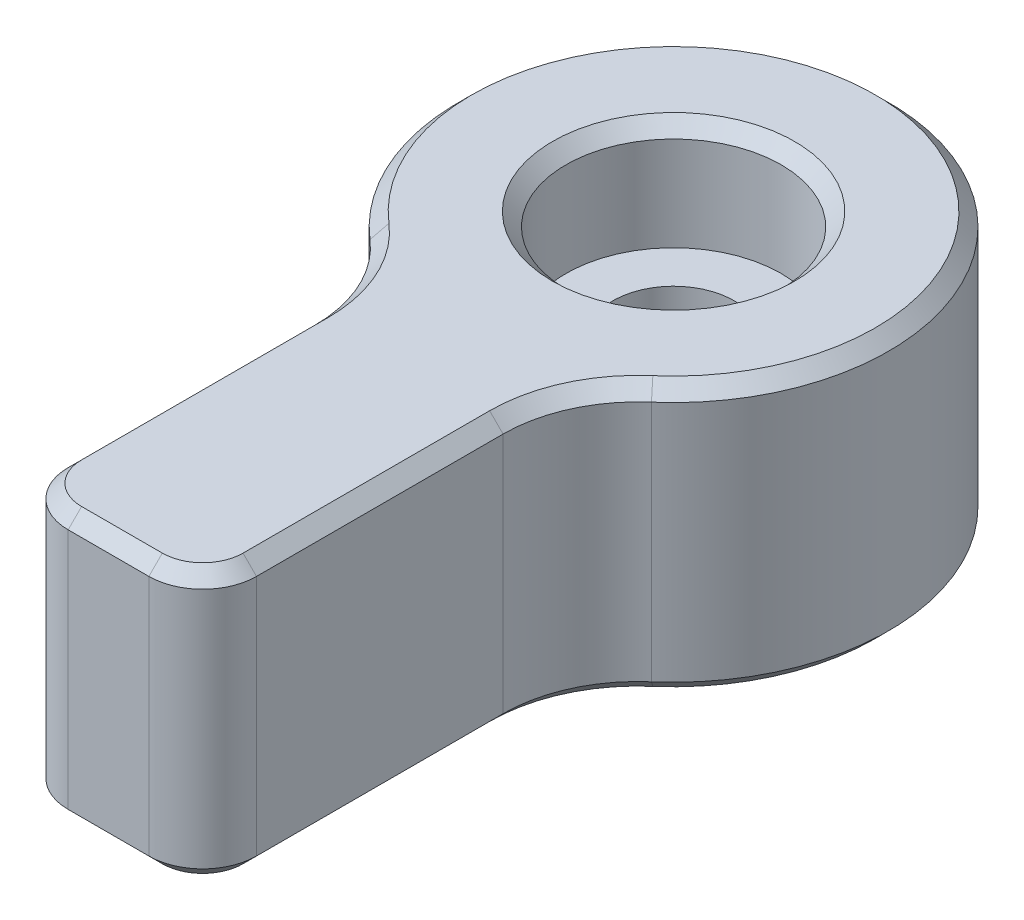
ISO-10303-21;
HEADER;
FILE_DESCRIPTION(('STEP AP214'),'2;1');
FILE_NAME('part.step','',(''),(''),'','','');
FILE_SCHEMA(('AUTOMOTIVE_DESIGN { 1 0 10303 214 1 1 1 1 }'));
ENDSEC;
DATA;
#1=APPLICATION_CONTEXT('core data for automotive mechanical design processes');
#2=APPLICATION_PROTOCOL_DEFINITION('international standard','automotive_design',2000,#1);
#3=PRODUCT_CONTEXT('',#1,'mechanical');
#4=PRODUCT('Part','Part','',(#3));
#5=PRODUCT_RELATED_PRODUCT_CATEGORY('part','',(#4));
#6=PRODUCT_DEFINITION_FORMATION('','',#4);
#7=PRODUCT_DEFINITION_CONTEXT('part definition',#1,'design');
#8=PRODUCT_DEFINITION('design','',#6,#7);
#9=PRODUCT_DEFINITION_SHAPE('','',#8);
#10=(LENGTH_UNIT() NAMED_UNIT(*) SI_UNIT(.MILLI.,.METRE.));
#11=(NAMED_UNIT(*) PLANE_ANGLE_UNIT() SI_UNIT($,.RADIAN.));
#12=(NAMED_UNIT(*) SI_UNIT($,.STERADIAN.) SOLID_ANGLE_UNIT());
#13=UNCERTAINTY_MEASURE_WITH_UNIT(LENGTH_MEASURE(1.E-05),#10,'distance_accuracy_value','');
#14=(GEOMETRIC_REPRESENTATION_CONTEXT(3) GLOBAL_UNCERTAINTY_ASSIGNED_CONTEXT((#13)) GLOBAL_UNIT_ASSIGNED_CONTEXT((#10,
#11,#12)) REPRESENTATION_CONTEXT('',''));
#15=CARTESIAN_POINT('',(0.,0.,0.));
#16=DIRECTION('',(0.,0.,1.));
#17=DIRECTION('',(1.,0.,0.));
#18=AXIS2_PLACEMENT_3D('',#15,#16,#17);
#19=CARTESIAN_POINT('',(3.5,10.,7.19374728496908));
#20=DIRECTION('',(-1.,0.,0.));
#21=DIRECTION('',(0.,0.,1.));
#22=AXIS2_PLACEMENT_3D('',#19,#20,#21);
#23=PLANE('',#22);
#24=DIRECTION('',(0.,-1.,0.));
#25=VECTOR('',#24,1.);
#26=CARTESIAN_POINT('',(3.50000000000001,10.,19.));
#27=LINE('',#26,#25);
#28=CARTESIAN_POINT('',(3.50000000000001,9.5,19.));
#29=VERTEX_POINT('',#28);
#30=CARTESIAN_POINT('',(3.50000000000001,0.5,19.));
#31=VERTEX_POINT('',#30);
#32=EDGE_CURVE('E334',#29,#31,#27,.T.);
#33=ORIENTED_EDGE('',*,*,#32,.T.);
#34=DIRECTION('',(0.,0.,-1.));
#35=VECTOR('',#34,1.);
#36=CARTESIAN_POINT('',(3.5,0.5,7.19374728496908));
#37=LINE('',#36,#35);
#38=CARTESIAN_POINT('',(3.50000000000001,0.5,9.836157786453));
#39=VERTEX_POINT('',#38);
#40=EDGE_CURVE('E211',#31,#39,#37,.T.);
#41=ORIENTED_EDGE('',*,*,#40,.T.);
#42=DIRECTION('',(0.,1.,0.));
#43=VECTOR('',#42,1.);
#44=CARTESIAN_POINT('',(3.50000000000001,10.,9.836157786453));
#45=LINE('',#44,#43);
#46=CARTESIAN_POINT('',(3.50000000000001,9.5,9.836157786453));
#47=VERTEX_POINT('',#46);
#48=EDGE_CURVE('E287',#39,#47,#45,.T.);
#49=ORIENTED_EDGE('',*,*,#48,.T.);
#50=DIRECTION('',(0.,0.,1.));
#51=VECTOR('',#50,1.);
#52=CARTESIAN_POINT('',(3.50000000000001,9.5,19.));
#53=LINE('',#52,#51);
#54=EDGE_CURVE('E209',#47,#29,#53,.T.);
#55=ORIENTED_EDGE('',*,*,#54,.T.);
#56=EDGE_LOOP('',(#33,#41,#49,#55));
#57=FACE_BOUND('',#56,.T.);
#58=ADVANCED_FACE('F34',(#57),#23,.F.);
#59=CARTESIAN_POINT('',(0.,10.,0.));
#60=DIRECTION('',(0.,-1.,0.));
#61=DIRECTION('',(0.,0.,-1.));
#62=AXIS2_PLACEMENT_3D('',#59,#60,#61);
#63=CYLINDRICAL_SURFACE('',#62,8.);
#64=DIRECTION('',(0.,-1.,0.));
#65=VECTOR('',#64,1.);
#66=CARTESIAN_POINT('',(5.23076923076923,10.,6.05302017627876));
#67=LINE('',#66,#65);
#68=CARTESIAN_POINT('',(5.23076923076923,9.5,6.05302017627876));
#69=VERTEX_POINT('',#68);
#70=CARTESIAN_POINT('',(5.23076923076923,0.5,6.05302017627876));
#71=VERTEX_POINT('',#70);
#72=EDGE_CURVE('E289',#69,#71,#67,.T.);
#73=ORIENTED_EDGE('',*,*,#72,.T.);
#74=CARTESIAN_POINT('',(0.,0.5,0.));
#75=DIRECTION('',(0.,1.,0.));
#76=DIRECTION('',(0.,0.,1.));
#77=AXIS2_PLACEMENT_3D('',#74,#75,#76);
#78=CIRCLE('',#77,8.);
#79=CARTESIAN_POINT('',(-5.23076923076923,0.5,6.05302017627877));
#80=VERTEX_POINT('',#79);
#81=EDGE_CURVE('E186',#71,#80,#78,.T.);
#82=ORIENTED_EDGE('',*,*,#81,.T.);
#83=DIRECTION('',(0.,-1.,0.));
#84=VECTOR('',#83,1.);
#85=CARTESIAN_POINT('',(-5.23076923076923,10.,6.05302017627877));
#86=LINE('',#85,#84);
#87=CARTESIAN_POINT('',(-5.23076923076923,9.5,6.05302017627877));
#88=VERTEX_POINT('',#87);
#89=EDGE_CURVE('E297',#80,#88,#86,.F.);
#90=ORIENTED_EDGE('',*,*,#89,.T.);
#91=CARTESIAN_POINT('',(0.,9.5,0.));
#92=DIRECTION('',(0.,1.,0.));
#93=DIRECTION('',(0.,0.,1.));
#94=AXIS2_PLACEMENT_3D('',#91,#92,#93);
#95=CIRCLE('',#94,8.);
#96=EDGE_CURVE('E184',#88,#69,#95,.F.);
#97=ORIENTED_EDGE('',*,*,#96,.T.);
#98=EDGE_LOOP('',(#73,#82,#90,#97));
#99=FACE_BOUND('',#98,.T.);
#100=ADVANCED_FACE('F322',(#99),#63,.T.);
#101=CARTESIAN_POINT('',(-3.49999999999999,10.,7.19374728496908));
#102=DIRECTION('',(1.,0.,0.));
#103=DIRECTION('',(0.,0.,-1.));
#104=AXIS2_PLACEMENT_3D('',#101,#102,#103);
#105=PLANE('',#104);
#106=DIRECTION('',(0.,1.,0.));
#107=VECTOR('',#106,1.);
#108=CARTESIAN_POINT('',(-3.49999999999999,0.,9.836157786453));
#109=LINE('',#108,#107);
#110=CARTESIAN_POINT('',(-3.49999999999999,9.5,9.836157786453));
#111=VERTEX_POINT('',#110);
#112=CARTESIAN_POINT('',(-3.49999999999999,0.5,9.836157786453));
#113=VERTEX_POINT('',#112);
#114=EDGE_CURVE('E293',#111,#113,#109,.F.);
#115=ORIENTED_EDGE('',*,*,#114,.T.);
#116=DIRECTION('',(0.,0.,1.));
#117=VECTOR('',#116,1.);
#118=CARTESIAN_POINT('',(-3.49999999999999,0.5,7.19374728496908));
#119=LINE('',#118,#117);
#120=CARTESIAN_POINT('',(-3.49999999999999,0.5,19.));
#121=VERTEX_POINT('',#120);
#122=EDGE_CURVE('E194',#113,#121,#119,.T.);
#123=ORIENTED_EDGE('',*,*,#122,.T.);
#124=DIRECTION('',(0.,-1.,0.));
#125=VECTOR('',#124,1.);
#126=CARTESIAN_POINT('',(-3.49999999999999,10.,19.));
#127=LINE('',#126,#125);
#128=CARTESIAN_POINT('',(-3.49999999999999,9.5,19.));
#129=VERTEX_POINT('',#128);
#130=EDGE_CURVE('E324',#121,#129,#127,.F.);
#131=ORIENTED_EDGE('',*,*,#130,.T.);
#132=DIRECTION('',(0.,0.,-1.));
#133=VECTOR('',#132,1.);
#134=CARTESIAN_POINT('',(-3.49999999999999,9.5,9.836157786453));
#135=LINE('',#134,#133);
#136=EDGE_CURVE('E192',#129,#111,#135,.T.);
#137=ORIENTED_EDGE('',*,*,#136,.T.);
#138=EDGE_LOOP('',(#115,#123,#131,#137));
#139=FACE_BOUND('',#138,.T.);
#140=ADVANCED_FACE('F364',(#139),#105,.F.);
#141=CARTESIAN_POINT('',(-3.49999999999999,10.,21.));
#142=DIRECTION('',(0.,0.,-1.));
#143=DIRECTION('',(-1.,0.,0.));
#144=AXIS2_PLACEMENT_3D('',#141,#142,#143);
#145=PLANE('',#144);
#146=DIRECTION('',(0.,-1.,0.));
#147=VECTOR('',#146,1.);
#148=CARTESIAN_POINT('',(-1.49999999999999,10.,21.));
#149=LINE('',#148,#147);
#150=CARTESIAN_POINT('',(-1.49999999999999,9.5,21.));
#151=VERTEX_POINT('',#150);
#152=CARTESIAN_POINT('',(-1.49999999999999,0.5,21.));
#153=VERTEX_POINT('',#152);
#154=EDGE_CURVE('E331',#151,#153,#149,.T.);
#155=ORIENTED_EDGE('',*,*,#154,.T.);
#156=DIRECTION('',(1.,0.,0.));
#157=VECTOR('',#156,1.);
#158=CARTESIAN_POINT('',(-3.49999999999999,0.5,21.));
#159=LINE('',#158,#157);
#160=CARTESIAN_POINT('',(1.50000000000001,0.5,21.));
#161=VERTEX_POINT('',#160);
#162=EDGE_CURVE('E203',#153,#161,#159,.T.);
#163=ORIENTED_EDGE('',*,*,#162,.T.);
#164=DIRECTION('',(0.,-1.,0.));
#165=VECTOR('',#164,1.);
#166=CARTESIAN_POINT('',(1.50000000000001,10.,21.));
#167=LINE('',#166,#165);
#168=CARTESIAN_POINT('',(1.50000000000001,9.5,21.));
#169=VERTEX_POINT('',#168);
#170=EDGE_CURVE('E326',#161,#169,#167,.F.);
#171=ORIENTED_EDGE('',*,*,#170,.T.);
#172=DIRECTION('',(-1.,0.,0.));
#173=VECTOR('',#172,1.);
#174=CARTESIAN_POINT('',(-1.49999999999999,9.5,21.));
#175=LINE('',#174,#173);
#176=EDGE_CURVE('E201',#169,#151,#175,.T.);
#177=ORIENTED_EDGE('',*,*,#176,.T.);
#178=EDGE_LOOP('',(#155,#163,#171,#177));
#179=FACE_BOUND('',#178,.T.);
#180=ADVANCED_FACE('F582',(#179),#145,.F.);
#181=CARTESIAN_POINT('',(0.,10.,0.));
#182=DIRECTION('',(0.,1.,0.));
#183=DIRECTION('',(0.,0.,1.));
#184=AXIS2_PLACEMENT_3D('',#181,#182,#183);
#185=PLANE('',#184);
#186=DIRECTION('',(0.,0.,1.));
#187=VECTOR('',#186,1.);
#188=CARTESIAN_POINT('',(-3.,10.,19.));
#189=LINE('',#188,#187);
#190=CARTESIAN_POINT('',(-3.,10.,9.836157786453));
#191=VERTEX_POINT('',#190);
#192=CARTESIAN_POINT('',(-3.,10.,19.));
#193=VERTEX_POINT('',#192);
#194=EDGE_CURVE('E51',#191,#193,#189,.T.);
#195=ORIENTED_EDGE('',*,*,#194,.T.);
#196=CARTESIAN_POINT('',(-1.49999999999999,10.,19.));
#197=DIRECTION('',(0.,1.,0.));
#198=DIRECTION('',(0.,0.,1.));
#199=AXIS2_PLACEMENT_3D('',#196,#197,#198);
#200=CIRCLE('',#199,1.50000000000001);
#201=CARTESIAN_POINT('',(-1.49999999999999,10.,20.5));
#202=VERTEX_POINT('',#201);
#203=EDGE_CURVE('E43',#193,#202,#200,.T.);
#204=ORIENTED_EDGE('',*,*,#203,.T.);
#205=DIRECTION('',(1.,0.,0.));
#206=VECTOR('',#205,1.);
#207=CARTESIAN_POINT('',(1.50000000000001,10.,20.5));
#208=LINE('',#207,#206);
#209=CARTESIAN_POINT('',(1.50000000000001,10.,20.5));
#210=VERTEX_POINT('',#209);
#211=EDGE_CURVE('E219',#202,#210,#208,.T.);
#212=ORIENTED_EDGE('',*,*,#211,.T.);
#213=CARTESIAN_POINT('',(1.50000000000001,10.,19.));
#214=DIRECTION('',(0.,1.,0.));
#215=DIRECTION('',(0.,0.,1.));
#216=AXIS2_PLACEMENT_3D('',#213,#214,#215);
#217=CIRCLE('',#216,1.50000000000001);
#218=CARTESIAN_POINT('',(3.00000000000001,10.,19.));
#219=VERTEX_POINT('',#218);
#220=EDGE_CURVE('E221',#210,#219,#217,.T.);
#221=ORIENTED_EDGE('',*,*,#220,.T.);
#222=DIRECTION('',(0.,0.,-1.));
#223=VECTOR('',#222,1.);
#224=CARTESIAN_POINT('',(3.00000000000001,10.,9.836157786453));
#225=LINE('',#224,#223);
#226=CARTESIAN_POINT('',(3.00000000000001,10.,9.836157786453));
#227=VERTEX_POINT('',#226);
#228=EDGE_CURVE('E223',#219,#227,#225,.T.);
#229=ORIENTED_EDGE('',*,*,#228,.T.);
#230=CARTESIAN_POINT('',(8.50000000000001,10.,9.83615778645299));
#231=DIRECTION('',(0.,1.,0.));
#232=DIRECTION('',(0.,0.,1.));
#233=AXIS2_PLACEMENT_3D('',#230,#231,#232);
#234=CIRCLE('',#233,5.49999999999999);
#235=CARTESIAN_POINT('',(4.90384615384616,10.,5.67470641526134));
#236=VERTEX_POINT('',#235);
#237=EDGE_CURVE('E225',#227,#236,#234,.F.);
#238=ORIENTED_EDGE('',*,*,#237,.T.);
#239=CARTESIAN_POINT('',(0.,10.,0.));
#240=DIRECTION('',(0.,1.,0.));
#241=DIRECTION('',(0.,0.,1.));
#242=AXIS2_PLACEMENT_3D('',#239,#240,#241);
#243=CIRCLE('',#242,7.50000000000001);
#244=CARTESIAN_POINT('',(-4.90384615384615,10.,5.67470641526135));
#245=VERTEX_POINT('',#244);
#246=EDGE_CURVE('E227',#236,#245,#243,.T.);
#247=ORIENTED_EDGE('',*,*,#246,.T.);
#248=CARTESIAN_POINT('',(-8.49999999999999,10.,9.836157786453));
#249=DIRECTION('',(0.,1.,0.));
#250=DIRECTION('',(0.,0.,1.));
#251=AXIS2_PLACEMENT_3D('',#248,#249,#250);
#252=CIRCLE('',#251,5.49999999999999);
#253=EDGE_CURVE('E56',#245,#191,#252,.F.);
#254=ORIENTED_EDGE('',*,*,#253,.T.);
#255=EDGE_LOOP('',(#195,#204,#212,#221,#229,#238,#247,#254));
#256=FACE_BOUND('',#255,.T.);
#257=CARTESIAN_POINT('',(0.,10.,0.));
#258=DIRECTION('',(0.,1.,0.));
#259=DIRECTION('',(0.,0.,1.));
#260=AXIS2_PLACEMENT_3D('',#257,#258,#259);
#261=CIRCLE('',#260,4.49999999999999);
#262=CARTESIAN_POINT('',(0.,10.,4.49999999999999));
#263=VERTEX_POINT('',#262);
#264=EDGE_CURVE('E216',#263,#263,#261,.F.);
#265=ORIENTED_EDGE('',*,*,#264,.T.);
#266=EDGE_LOOP('',(#265));
#267=FACE_BOUND('',#266,.T.);
#268=ADVANCED_FACE('F574',(#256,#267),#185,.T.);
#269=CARTESIAN_POINT('',(0.,0.,0.));
#270=DIRECTION('',(0.,1.,0.));
#271=DIRECTION('',(0.,0.,1.));
#272=AXIS2_PLACEMENT_3D('',#269,#270,#271);
#273=PLANE('',#272);
#274=CARTESIAN_POINT('',(0.,0.,0.));
#275=DIRECTION('',(0.,1.,0.));
#276=DIRECTION('',(0.,0.,1.));
#277=AXIS2_PLACEMENT_3D('',#274,#275,#276);
#278=CIRCLE('',#277,7.49999999999999);
#279=CARTESIAN_POINT('',(-4.90384615384615,0.,5.67470641526134));
#280=VERTEX_POINT('',#279);
#281=CARTESIAN_POINT('',(4.90384615384616,0.,5.67470641526134));
#282=VERTEX_POINT('',#281);
#283=EDGE_CURVE('E174',#280,#282,#278,.F.);
#284=ORIENTED_EDGE('',*,*,#283,.T.);
#285=CARTESIAN_POINT('',(8.50000000000001,0.,9.83615778645299));
#286=DIRECTION('',(0.,1.,0.));
#287=DIRECTION('',(0.,0.,1.));
#288=AXIS2_PLACEMENT_3D('',#285,#286,#287);
#289=CIRCLE('',#288,5.50000000000001);
#290=CARTESIAN_POINT('',(3.,0.,9.836157786453));
#291=VERTEX_POINT('',#290);
#292=EDGE_CURVE('E154',#282,#291,#289,.T.);
#293=ORIENTED_EDGE('',*,*,#292,.T.);
#294=DIRECTION('',(0.,0.,1.));
#295=VECTOR('',#294,1.);
#296=CARTESIAN_POINT('',(3.,0.,0.));
#297=LINE('',#296,#295);
#298=CARTESIAN_POINT('',(3.,0.,19.));
#299=VERTEX_POINT('',#298);
#300=EDGE_CURVE('E162',#291,#299,#297,.T.);
#301=ORIENTED_EDGE('',*,*,#300,.T.);
#302=CARTESIAN_POINT('',(1.50000000000001,0.,19.));
#303=DIRECTION('',(0.,1.,0.));
#304=DIRECTION('',(0.,0.,1.));
#305=AXIS2_PLACEMENT_3D('',#302,#303,#304);
#306=CIRCLE('',#305,1.49999999999999);
#307=CARTESIAN_POINT('',(1.50000000000001,0.,20.5));
#308=VERTEX_POINT('',#307);
#309=EDGE_CURVE('E168',#299,#308,#306,.F.);
#310=ORIENTED_EDGE('',*,*,#309,.T.);
#311=DIRECTION('',(-1.,0.,0.));
#312=VECTOR('',#311,1.);
#313=CARTESIAN_POINT('',(0.,0.,20.5));
#314=LINE('',#313,#312);
#315=CARTESIAN_POINT('',(-1.49999999999999,0.,20.5));
#316=VERTEX_POINT('',#315);
#317=EDGE_CURVE('E304',#308,#316,#314,.T.);
#318=ORIENTED_EDGE('',*,*,#317,.T.);
#319=CARTESIAN_POINT('',(-1.49999999999999,0.,19.));
#320=DIRECTION('',(0.,1.,0.));
#321=DIRECTION('',(0.,0.,1.));
#322=AXIS2_PLACEMENT_3D('',#319,#320,#321);
#323=CIRCLE('',#322,1.5);
#324=CARTESIAN_POINT('',(-2.99999999999999,0.,19.));
#325=VERTEX_POINT('',#324);
#326=EDGE_CURVE('E306',#316,#325,#323,.F.);
#327=ORIENTED_EDGE('',*,*,#326,.T.);
#328=DIRECTION('',(0.,0.,-1.));
#329=VECTOR('',#328,1.);
#330=CARTESIAN_POINT('',(-2.99999999999999,0.,0.));
#331=LINE('',#330,#329);
#332=CARTESIAN_POINT('',(-2.99999999999999,0.,9.836157786453));
#333=VERTEX_POINT('',#332);
#334=EDGE_CURVE('E308',#325,#333,#331,.T.);
#335=ORIENTED_EDGE('',*,*,#334,.T.);
#336=CARTESIAN_POINT('',(-8.49999999999999,0.,9.836157786453));
#337=DIRECTION('',(0.,1.,0.));
#338=DIRECTION('',(0.,0.,1.));
#339=AXIS2_PLACEMENT_3D('',#336,#337,#338);
#340=CIRCLE('',#339,5.5);
#341=EDGE_CURVE('E179',#333,#280,#340,.T.);
#342=ORIENTED_EDGE('',*,*,#341,.T.);
#343=EDGE_LOOP('',(#284,#293,#301,#310,#318,#327,#335,#342));
#344=FACE_BOUND('',#343,.T.);
#345=CARTESIAN_POINT('',(0.,0.,0.));
#346=DIRECTION('',(0.,1.,0.));
#347=DIRECTION('',(0.,0.,1.));
#348=AXIS2_PLACEMENT_3D('',#345,#346,#347);
#349=CIRCLE('',#348,2.75);
#350=CARTESIAN_POINT('',(0.,0.,2.75));
#351=VERTEX_POINT('',#350);
#352=EDGE_CURVE('E169',#351,#351,#349,.T.);
#353=ORIENTED_EDGE('',*,*,#352,.T.);
#354=EDGE_LOOP('',(#353));
#355=FACE_BOUND('',#354,.T.);
#356=ADVANCED_FACE('F171',(#344,#355),#273,.F.);
#357=CARTESIAN_POINT('',(0.,10.,0.));
#358=DIRECTION('',(0.,1.,0.));
#359=DIRECTION('',(0.,0.,1.));
#360=AXIS2_PLACEMENT_3D('',#357,#358,#359);
#361=CYLINDRICAL_SURFACE('',#360,2.25);
#362=CARTESIAN_POINT('',(0.,0.499999999999999,0.));
#363=DIRECTION('',(0.,1.,0.));
#364=DIRECTION('',(0.,0.,1.));
#365=AXIS2_PLACEMENT_3D('',#362,#363,#364);
#366=CIRCLE('',#365,2.25);
#367=CARTESIAN_POINT('',(0.,0.499999999999999,2.25));
#368=VERTEX_POINT('',#367);
#369=EDGE_CURVE('E213',#368,#368,#366,.F.);
#370=ORIENTED_EDGE('',*,*,#369,.T.);
#371=EDGE_LOOP('',(#370));
#372=FACE_BOUND('',#371,.T.);
#373=CARTESIAN_POINT('',(0.,6.,0.));
#374=DIRECTION('',(0.,1.,0.));
#375=DIRECTION('',(0.,0.,1.));
#376=AXIS2_PLACEMENT_3D('',#373,#374,#375);
#377=CIRCLE('',#376,2.25);
#378=CARTESIAN_POINT('',(0.,6.,2.25));
#379=VERTEX_POINT('',#378);
#380=EDGE_CURVE('E336',#379,#379,#377,.T.);
#381=ORIENTED_EDGE('',*,*,#380,.T.);
#382=EDGE_LOOP('',(#381));
#383=FACE_BOUND('',#382,.T.);
#384=ADVANCED_FACE('F356',(#372,#383),#361,.F.);
#385=CARTESIAN_POINT('',(2.25,6.,0.));
#386=DIRECTION('',(0.,-1.,0.));
#387=DIRECTION('',(0.,0.,-1.));
#388=AXIS2_PLACEMENT_3D('',#385,#386,#387);
#389=PLANE('',#388);
#390=ORIENTED_EDGE('',*,*,#380,.F.);
#391=EDGE_LOOP('',(#390));
#392=FACE_BOUND('',#391,.T.);
#393=CARTESIAN_POINT('',(0.,6.,0.));
#394=DIRECTION('',(0.,1.,0.));
#395=DIRECTION('',(0.,0.,1.));
#396=AXIS2_PLACEMENT_3D('',#393,#394,#395);
#397=CIRCLE('',#396,4.);
#398=CARTESIAN_POINT('',(0.,6.,4.));
#399=VERTEX_POINT('',#398);
#400=EDGE_CURVE('E249',#399,#399,#397,.T.);
#401=ORIENTED_EDGE('',*,*,#400,.T.);
#402=EDGE_LOOP('',(#401));
#403=FACE_BOUND('',#402,.T.);
#404=ADVANCED_FACE('F342',(#392,#403),#389,.F.);
#405=CARTESIAN_POINT('',(0.,10.,0.));
#406=DIRECTION('',(0.,1.,0.));
#407=DIRECTION('',(0.,0.,1.));
#408=AXIS2_PLACEMENT_3D('',#405,#406,#407);
#409=CYLINDRICAL_SURFACE('',#408,3.99999999999999);
#410=CARTESIAN_POINT('',(0.,9.50000000000001,0.));
#411=DIRECTION('',(0.,1.,0.));
#412=DIRECTION('',(0.,0.,1.));
#413=AXIS2_PLACEMENT_3D('',#410,#411,#412);
#414=CIRCLE('',#413,3.99999999999999);
#415=CARTESIAN_POINT('',(0.,9.50000000000001,3.99999999999999));
#416=VERTEX_POINT('',#415);
#417=EDGE_CURVE('E11',#416,#416,#414,.T.);
#418=ORIENTED_EDGE('',*,*,#417,.T.);
#419=EDGE_LOOP('',(#418));
#420=FACE_BOUND('',#419,.T.);
#421=ORIENTED_EDGE('',*,*,#400,.F.);
#422=EDGE_LOOP('',(#421));
#423=FACE_BOUND('',#422,.T.);
#424=ADVANCED_FACE('F344',(#420,#423),#409,.F.);
#425=CARTESIAN_POINT('',(1.50000000000001,10.,19.));
#426=DIRECTION('',(0.,-1.,0.));
#427=DIRECTION('',(0.,0.,-1.));
#428=AXIS2_PLACEMENT_3D('',#425,#426,#427);
#429=CYLINDRICAL_SURFACE('',#428,2.);
#430=ORIENTED_EDGE('',*,*,#170,.F.);
#431=CARTESIAN_POINT('',(1.50000000000001,0.5,19.));
#432=DIRECTION('',(0.,1.,0.));
#433=DIRECTION('',(0.,0.,1.));
#434=AXIS2_PLACEMENT_3D('',#431,#432,#433);
#435=CIRCLE('',#434,2.);
#436=EDGE_CURVE('E207',#161,#31,#435,.T.);
#437=ORIENTED_EDGE('',*,*,#436,.T.);
#438=ORIENTED_EDGE('',*,*,#32,.F.);
#439=CARTESIAN_POINT('',(1.50000000000001,9.5,19.));
#440=DIRECTION('',(0.,1.,0.));
#441=DIRECTION('',(0.,0.,1.));
#442=AXIS2_PLACEMENT_3D('',#439,#440,#441);
#443=CIRCLE('',#442,2.);
#444=EDGE_CURVE('E205',#29,#169,#443,.F.);
#445=ORIENTED_EDGE('',*,*,#444,.T.);
#446=EDGE_LOOP('',(#430,#437,#438,#445));
#447=FACE_BOUND('',#446,.T.);
#448=ADVANCED_FACE('F346',(#447),#429,.T.);
#449=CARTESIAN_POINT('',(-1.49999999999999,10.,19.));
#450=DIRECTION('',(0.,-1.,0.));
#451=DIRECTION('',(0.,0.,-1.));
#452=AXIS2_PLACEMENT_3D('',#449,#450,#451);
#453=CYLINDRICAL_SURFACE('',#452,2.);
#454=ORIENTED_EDGE('',*,*,#130,.F.);
#455=CARTESIAN_POINT('',(-1.49999999999999,0.5,19.));
#456=DIRECTION('',(0.,1.,0.));
#457=DIRECTION('',(0.,0.,1.));
#458=AXIS2_PLACEMENT_3D('',#455,#456,#457);
#459=CIRCLE('',#458,2.);
#460=EDGE_CURVE('E199',#121,#153,#459,.T.);
#461=ORIENTED_EDGE('',*,*,#460,.T.);
#462=ORIENTED_EDGE('',*,*,#154,.F.);
#463=CARTESIAN_POINT('',(-1.49999999999999,9.5,19.));
#464=DIRECTION('',(0.,1.,0.));
#465=DIRECTION('',(0.,0.,1.));
#466=AXIS2_PLACEMENT_3D('',#463,#464,#465);
#467=CIRCLE('',#466,2.);
#468=EDGE_CURVE('E196',#151,#129,#467,.F.);
#469=ORIENTED_EDGE('',*,*,#468,.T.);
#470=EDGE_LOOP('',(#454,#461,#462,#469));
#471=FACE_BOUND('',#470,.T.);
#472=ADVANCED_FACE('F353',(#471),#453,.T.);
#473=CARTESIAN_POINT('',(8.50000000000001,10.,9.83615778645299));
#474=DIRECTION('',(0.,-1.,0.));
#475=DIRECTION('',(0.,0.,-1.));
#476=AXIS2_PLACEMENT_3D('',#473,#474,#475);
#477=CYLINDRICAL_SURFACE('',#476,5.);
#478=ORIENTED_EDGE('',*,*,#48,.F.);
#479=CARTESIAN_POINT('',(8.50000000000001,0.5,9.83615778645299));
#480=DIRECTION('',(0.,1.,0.));
#481=DIRECTION('',(0.,0.,1.));
#482=AXIS2_PLACEMENT_3D('',#479,#480,#481);
#483=CIRCLE('',#482,5.);
#484=EDGE_CURVE('E156',#39,#71,#483,.F.);
#485=ORIENTED_EDGE('',*,*,#484,.T.);
#486=ORIENTED_EDGE('',*,*,#72,.F.);
#487=CARTESIAN_POINT('',(8.50000000000001,9.5,9.83615778645299));
#488=DIRECTION('',(0.,1.,0.));
#489=DIRECTION('',(0.,0.,1.));
#490=AXIS2_PLACEMENT_3D('',#487,#488,#489);
#491=CIRCLE('',#490,5.);
#492=EDGE_CURVE('E176',#69,#47,#491,.T.);
#493=ORIENTED_EDGE('',*,*,#492,.T.);
#494=EDGE_LOOP('',(#478,#485,#486,#493));
#495=FACE_BOUND('',#494,.T.);
#496=ADVANCED_FACE('F286',(#495),#477,.F.);
#497=CARTESIAN_POINT('',(-8.49999999999999,10.,9.836157786453));
#498=DIRECTION('',(0.,-1.,0.));
#499=DIRECTION('',(0.,0.,-1.));
#500=AXIS2_PLACEMENT_3D('',#497,#498,#499);
#501=CYLINDRICAL_SURFACE('',#500,5.);
#502=ORIENTED_EDGE('',*,*,#89,.F.);
#503=CARTESIAN_POINT('',(-8.49999999999999,0.5,9.836157786453));
#504=DIRECTION('',(0.,1.,0.));
#505=DIRECTION('',(0.,0.,1.));
#506=AXIS2_PLACEMENT_3D('',#503,#504,#505);
#507=CIRCLE('',#506,5.);
#508=EDGE_CURVE('E190',#80,#113,#507,.F.);
#509=ORIENTED_EDGE('',*,*,#508,.T.);
#510=ORIENTED_EDGE('',*,*,#114,.F.);
#511=CARTESIAN_POINT('',(-8.49999999999999,9.5,9.836157786453));
#512=DIRECTION('',(0.,1.,0.));
#513=DIRECTION('',(0.,0.,1.));
#514=AXIS2_PLACEMENT_3D('',#511,#512,#513);
#515=CIRCLE('',#514,5.);
#516=EDGE_CURVE('E188',#111,#88,#515,.T.);
#517=ORIENTED_EDGE('',*,*,#516,.T.);
#518=EDGE_LOOP('',(#502,#509,#510,#517));
#519=FACE_BOUND('',#518,.T.);
#520=ADVANCED_FACE('F373',(#519),#501,.F.);
#521=CARTESIAN_POINT('',(-1.49999999999999,0.,19.));
#522=DIRECTION('',(0.,1.,0.));
#523=DIRECTION('',(0.,0.,1.));
#524=AXIS2_PLACEMENT_3D('',#521,#522,#523);
#525=CONICAL_SURFACE('',#524,1.5,0.785398163397452);
#526=DIRECTION('',(0.,-0.707106781186545,-0.70710678118655));
#527=VECTOR('',#526,1.);
#528=CARTESIAN_POINT('',(-1.49999999999999,0.5,21.));
#529=LINE('',#528,#527);
#530=EDGE_CURVE('E243',#153,#316,#529,.T.);
#531=ORIENTED_EDGE('',*,*,#530,.F.);
#532=ORIENTED_EDGE('',*,*,#460,.F.);
#533=DIRECTION('',(-0.70710678118655,0.707106781186545,0.));
#534=VECTOR('',#533,1.);
#535=CARTESIAN_POINT('',(-2.99999999999999,0.,19.));
#536=LINE('',#535,#534);
#537=EDGE_CURVE('E246',#325,#121,#536,.T.);
#538=ORIENTED_EDGE('',*,*,#537,.F.);
#539=ORIENTED_EDGE('',*,*,#326,.F.);
#540=EDGE_LOOP('',(#531,#532,#538,#539));
#541=FACE_BOUND('',#540,.T.);
#542=ADVANCED_FACE('F376',(#541),#525,.T.);
#543=CARTESIAN_POINT('',(-3.49999999999999,0.5,7.19374728496908));
#544=DIRECTION('',(0.707106781186545,0.70710678118655,0.));
#545=DIRECTION('',(0.,0.,1.));
#546=AXIS2_PLACEMENT_3D('',#543,#544,#545);
#547=PLANE('',#546);
#548=ORIENTED_EDGE('',*,*,#537,.T.);
#549=ORIENTED_EDGE('',*,*,#122,.F.);
#550=DIRECTION('',(-0.70710678118655,0.707106781186545,0.));
#551=VECTOR('',#550,1.);
#552=CARTESIAN_POINT('',(-2.99999999999999,0.,9.836157786453));
#553=LINE('',#552,#551);
#554=EDGE_CURVE('E240',#333,#113,#553,.T.);
#555=ORIENTED_EDGE('',*,*,#554,.F.);
#556=ORIENTED_EDGE('',*,*,#334,.F.);
#557=EDGE_LOOP('',(#548,#549,#555,#556));
#558=FACE_BOUND('',#557,.T.);
#559=ADVANCED_FACE('F393',(#558),#547,.F.);
#560=CARTESIAN_POINT('',(-3.49999999999999,0.5,21.));
#561=DIRECTION('',(0.,0.70710678118655,-0.707106781186545));
#562=DIRECTION('',(1.,0.,0.));
#563=AXIS2_PLACEMENT_3D('',#560,#561,#562);
#564=PLANE('',#563);
#565=ORIENTED_EDGE('',*,*,#530,.T.);
#566=ORIENTED_EDGE('',*,*,#317,.F.);
#567=DIRECTION('',(0.,-0.707106781186545,-0.70710678118655));
#568=VECTOR('',#567,1.);
#569=CARTESIAN_POINT('',(1.50000000000001,0.5,21.));
#570=LINE('',#569,#568);
#571=EDGE_CURVE('E237',#161,#308,#570,.T.);
#572=ORIENTED_EDGE('',*,*,#571,.F.);
#573=ORIENTED_EDGE('',*,*,#162,.F.);
#574=EDGE_LOOP('',(#565,#566,#572,#573));
#575=FACE_BOUND('',#574,.T.);
#576=ADVANCED_FACE('F390',(#575),#564,.F.);
#577=CARTESIAN_POINT('',(-8.49999999999999,0.,9.836157786453));
#578=DIRECTION('',(0.,-1.,0.));
#579=DIRECTION('',(0.,0.,-1.));
#580=AXIS2_PLACEMENT_3D('',#577,#578,#579);
#581=CONICAL_SURFACE('',#580,5.5,0.785398163397452);
#582=ORIENTED_EDGE('',*,*,#554,.T.);
#583=ORIENTED_EDGE('',*,*,#508,.F.);
#584=DIRECTION('',(-0.46233904923736,0.707106781186545,0.535016451663215));
#585=VECTOR('',#584,1.);
#586=CARTESIAN_POINT('',(-4.90384615384615,0.,5.67470641526134));
#587=LINE('',#586,#585);
#588=EDGE_CURVE('E234',#280,#80,#587,.T.);
#589=ORIENTED_EDGE('',*,*,#588,.F.);
#590=ORIENTED_EDGE('',*,*,#341,.F.);
#591=EDGE_LOOP('',(#582,#583,#589,#590));
#592=FACE_BOUND('',#591,.T.);
#593=ADVANCED_FACE('F315',(#592),#581,.F.);
#594=CARTESIAN_POINT('',(1.50000000000001,0.,19.));
#595=DIRECTION('',(0.,1.,0.));
#596=DIRECTION('',(0.,0.,1.));
#597=AXIS2_PLACEMENT_3D('',#594,#595,#596);
#598=CONICAL_SURFACE('',#597,1.49999999999999,0.785398163397454);
#599=ORIENTED_EDGE('',*,*,#571,.T.);
#600=ORIENTED_EDGE('',*,*,#309,.F.);
#601=DIRECTION('',(-0.707106781186551,-0.707106781186544,0.));
#602=VECTOR('',#601,1.);
#603=CARTESIAN_POINT('',(3.50000000000001,0.5,19.));
#604=LINE('',#603,#602);
#605=EDGE_CURVE('E165',#31,#299,#604,.T.);
#606=ORIENTED_EDGE('',*,*,#605,.F.);
#607=ORIENTED_EDGE('',*,*,#436,.F.);
#608=EDGE_LOOP('',(#599,#600,#606,#607));
#609=FACE_BOUND('',#608,.T.);
#610=ADVANCED_FACE('F384',(#609),#598,.T.);
#611=CARTESIAN_POINT('',(0.,0.5,0.));
#612=DIRECTION('',(0.,1.,0.));
#613=DIRECTION('',(0.,0.,1.));
#614=AXIS2_PLACEMENT_3D('',#611,#612,#613);
#615=CONICAL_SURFACE('',#614,8.,0.785398163397452);
#616=ORIENTED_EDGE('',*,*,#588,.T.);
#617=ORIENTED_EDGE('',*,*,#81,.F.);
#618=DIRECTION('',(0.462339049237359,0.707106781186544,0.535016451663216));
#619=VECTOR('',#618,1.);
#620=CARTESIAN_POINT('',(4.90384615384616,0.,5.67470641526134));
#621=LINE('',#620,#619);
#622=EDGE_CURVE('E159',#282,#71,#621,.T.);
#623=ORIENTED_EDGE('',*,*,#622,.F.);
#624=ORIENTED_EDGE('',*,*,#283,.F.);
#625=EDGE_LOOP('',(#616,#617,#623,#624));
#626=FACE_BOUND('',#625,.T.);
#627=ADVANCED_FACE('F318',(#626),#615,.T.);
#628=CARTESIAN_POINT('',(3.5,0.5,7.19374728496908));
#629=DIRECTION('',(-0.707106781186545,0.70710678118655,0.));
#630=DIRECTION('',(0.,0.,-1.));
#631=AXIS2_PLACEMENT_3D('',#628,#629,#630);
#632=PLANE('',#631);
#633=ORIENTED_EDGE('',*,*,#605,.T.);
#634=ORIENTED_EDGE('',*,*,#300,.F.);
#635=DIRECTION('',(-0.70710678118655,-0.707106781186545,0.));
#636=VECTOR('',#635,1.);
#637=CARTESIAN_POINT('',(3.50000000000001,0.5,9.836157786453));
#638=LINE('',#637,#636);
#639=EDGE_CURVE('E150',#39,#291,#638,.T.);
#640=ORIENTED_EDGE('',*,*,#639,.F.);
#641=ORIENTED_EDGE('',*,*,#40,.F.);
#642=EDGE_LOOP('',(#633,#634,#640,#641));
#643=FACE_BOUND('',#642,.T.);
#644=ADVANCED_FACE('F163',(#643),#632,.F.);
#645=CARTESIAN_POINT('',(8.50000000000001,0.,9.83615778645299));
#646=DIRECTION('',(0.,-1.,0.));
#647=DIRECTION('',(0.,0.,-1.));
#648=AXIS2_PLACEMENT_3D('',#645,#646,#647);
#649=CONICAL_SURFACE('',#648,5.5,0.785398163397452);
#650=ORIENTED_EDGE('',*,*,#622,.T.);
#651=ORIENTED_EDGE('',*,*,#484,.F.);
#652=ORIENTED_EDGE('',*,*,#639,.T.);
#653=ORIENTED_EDGE('',*,*,#292,.F.);
#654=EDGE_LOOP('',(#650,#651,#652,#653));
#655=FACE_BOUND('',#654,.T.);
#656=ADVANCED_FACE('F152',(#655),#649,.F.);
#657=CARTESIAN_POINT('',(0.,0.,0.));
#658=DIRECTION('',(0.,-1.,0.));
#659=DIRECTION('',(0.,0.,-1.));
#660=AXIS2_PLACEMENT_3D('',#657,#658,#659);
#661=CONICAL_SURFACE('',#660,2.75,0.785398163397445);
#662=ORIENTED_EDGE('',*,*,#369,.F.);
#663=EDGE_LOOP('',(#662));
#664=FACE_BOUND('',#663,.T.);
#665=ORIENTED_EDGE('',*,*,#352,.F.);
#666=EDGE_LOOP('',(#665));
#667=FACE_BOUND('',#666,.T.);
#668=ADVANCED_FACE('F379',(#664,#667),#661,.F.);
#669=CARTESIAN_POINT('',(8.50000000000001,10.,9.83615778645299));
#670=DIRECTION('',(0.,1.,0.));
#671=DIRECTION('',(0.,0.,1.));
#672=AXIS2_PLACEMENT_3D('',#669,#670,#671);
#673=CONICAL_SURFACE('',#672,5.49999999999999,0.785398163397441);
#674=DIRECTION('',(-0.707106781186543,0.707106781186552,0.));
#675=VECTOR('',#674,1.);
#676=CARTESIAN_POINT('',(3.50000000000001,9.5,9.836157786453));
#677=LINE('',#676,#675);
#678=EDGE_CURVE('E265',#47,#227,#677,.T.);
#679=ORIENTED_EDGE('',*,*,#678,.F.);
#680=ORIENTED_EDGE('',*,*,#492,.F.);
#681=DIRECTION('',(0.462339049237355,-0.707106781186552,0.53501645166321));
#682=VECTOR('',#681,1.);
#683=CARTESIAN_POINT('',(4.90384615384616,10.,5.67470641526134));
#684=LINE('',#683,#682);
#685=EDGE_CURVE('E38',#236,#69,#684,.T.);
#686=ORIENTED_EDGE('',*,*,#685,.F.);
#687=ORIENTED_EDGE('',*,*,#237,.F.);
#688=EDGE_LOOP('',(#679,#680,#686,#687));
#689=FACE_BOUND('',#688,.T.);
#690=ADVANCED_FACE('F281',(#689),#673,.F.);
#691=CARTESIAN_POINT('',(0.,10.,0.));
#692=DIRECTION('',(0.,-1.,0.));
#693=DIRECTION('',(0.,0.,-1.));
#694=AXIS2_PLACEMENT_3D('',#691,#692,#693);
#695=CONICAL_SURFACE('',#694,7.50000000000001,0.785398163397441);
#696=ORIENTED_EDGE('',*,*,#685,.T.);
#697=ORIENTED_EDGE('',*,*,#96,.F.);
#698=DIRECTION('',(-0.462339049237355,-0.707106781186552,0.53501645166321));
#699=VECTOR('',#698,1.);
#700=CARTESIAN_POINT('',(-4.90384615384615,10.,5.67470641526135));
#701=LINE('',#700,#699);
#702=EDGE_CURVE('E263',#245,#88,#701,.T.);
#703=ORIENTED_EDGE('',*,*,#702,.F.);
#704=ORIENTED_EDGE('',*,*,#246,.F.);
#705=EDGE_LOOP('',(#696,#697,#703,#704));
#706=FACE_BOUND('',#705,.T.);
#707=ADVANCED_FACE('F276',(#706),#695,.T.);
#708=CARTESIAN_POINT('',(3.00000000000001,10.,0.));
#709=DIRECTION('',(0.707106781186552,0.707106781186543,0.));
#710=DIRECTION('',(0.,0.,1.));
#711=AXIS2_PLACEMENT_3D('',#708,#709,#710);
#712=PLANE('',#711);
#713=ORIENTED_EDGE('',*,*,#678,.T.);
#714=ORIENTED_EDGE('',*,*,#228,.F.);
#715=DIRECTION('',(-0.707106781186543,0.707106781186552,0.));
#716=VECTOR('',#715,1.);
#717=CARTESIAN_POINT('',(3.50000000000001,9.5,19.));
#718=LINE('',#717,#716);
#719=EDGE_CURVE('E260',#29,#219,#718,.T.);
#720=ORIENTED_EDGE('',*,*,#719,.F.);
#721=ORIENTED_EDGE('',*,*,#54,.F.);
#722=EDGE_LOOP('',(#713,#714,#720,#721));
#723=FACE_BOUND('',#722,.T.);
#724=ADVANCED_FACE('F423',(#723),#712,.T.);
#725=CARTESIAN_POINT('',(-8.49999999999999,10.,9.836157786453));
#726=DIRECTION('',(0.,1.,0.));
#727=DIRECTION('',(0.,0.,1.));
#728=AXIS2_PLACEMENT_3D('',#725,#726,#727);
#729=CONICAL_SURFACE('',#728,5.49999999999999,0.785398163397441);
#730=ORIENTED_EDGE('',*,*,#702,.T.);
#731=ORIENTED_EDGE('',*,*,#516,.F.);
#732=DIRECTION('',(-0.707106781186543,-0.707106781186552,0.));
#733=VECTOR('',#732,1.);
#734=CARTESIAN_POINT('',(-3.,10.,9.836157786453));
#735=LINE('',#734,#733);
#736=EDGE_CURVE('E257',#191,#111,#735,.T.);
#737=ORIENTED_EDGE('',*,*,#736,.F.);
#738=ORIENTED_EDGE('',*,*,#253,.F.);
#739=EDGE_LOOP('',(#730,#731,#737,#738));
#740=FACE_BOUND('',#739,.T.);
#741=ADVANCED_FACE('F419',(#740),#729,.F.);
#742=CARTESIAN_POINT('',(1.50000000000001,10.,19.));
#743=DIRECTION('',(0.,-1.,0.));
#744=DIRECTION('',(0.,0.,-1.));
#745=AXIS2_PLACEMENT_3D('',#742,#743,#744);
#746=CONICAL_SURFACE('',#745,1.5,0.785398163397443);
#747=ORIENTED_EDGE('',*,*,#719,.T.);
#748=ORIENTED_EDGE('',*,*,#220,.F.);
#749=DIRECTION('',(0.,0.707106781186552,-0.707106781186543));
#750=VECTOR('',#749,1.);
#751=CARTESIAN_POINT('',(1.50000000000001,9.5,21.));
#752=LINE('',#751,#750);
#753=EDGE_CURVE('E254',#169,#210,#752,.T.);
#754=ORIENTED_EDGE('',*,*,#753,.F.);
#755=ORIENTED_EDGE('',*,*,#444,.F.);
#756=EDGE_LOOP('',(#747,#748,#754,#755));
#757=FACE_BOUND('',#756,.T.);
#758=ADVANCED_FACE('F415',(#757),#746,.T.);
#759=CARTESIAN_POINT('',(-3.,10.,0.));
#760=DIRECTION('',(-0.707106781186552,0.707106781186543,0.));
#761=DIRECTION('',(0.,0.,-1.));
#762=AXIS2_PLACEMENT_3D('',#759,#760,#761);
#763=PLANE('',#762);
#764=ORIENTED_EDGE('',*,*,#736,.T.);
#765=ORIENTED_EDGE('',*,*,#136,.F.);
#766=DIRECTION('',(-0.707106781186543,-0.707106781186552,0.));
#767=VECTOR('',#766,1.);
#768=CARTESIAN_POINT('',(-3.,10.,19.));
#769=LINE('',#768,#767);
#770=EDGE_CURVE('E252',#193,#129,#769,.T.);
#771=ORIENTED_EDGE('',*,*,#770,.F.);
#772=ORIENTED_EDGE('',*,*,#194,.F.);
#773=EDGE_LOOP('',(#764,#765,#771,#772));
#774=FACE_BOUND('',#773,.T.);
#775=ADVANCED_FACE('F411',(#774),#763,.T.);
#776=CARTESIAN_POINT('',(0.,10.,20.5));
#777=DIRECTION('',(0.,0.707106781186543,0.707106781186552));
#778=DIRECTION('',(-1.,0.,0.));
#779=AXIS2_PLACEMENT_3D('',#776,#777,#778);
#780=PLANE('',#779);
#781=ORIENTED_EDGE('',*,*,#753,.T.);
#782=ORIENTED_EDGE('',*,*,#211,.F.);
#783=DIRECTION('',(0.,0.707106781186552,-0.707106781186543));
#784=VECTOR('',#783,1.);
#785=CARTESIAN_POINT('',(-1.49999999999999,9.5,21.));
#786=LINE('',#785,#784);
#787=EDGE_CURVE('E250',#151,#202,#786,.T.);
#788=ORIENTED_EDGE('',*,*,#787,.F.);
#789=ORIENTED_EDGE('',*,*,#176,.F.);
#790=EDGE_LOOP('',(#781,#782,#788,#789));
#791=FACE_BOUND('',#790,.T.);
#792=ADVANCED_FACE('F407',(#791),#780,.T.);
#793=CARTESIAN_POINT('',(-1.49999999999999,10.,19.));
#794=DIRECTION('',(0.,-1.,0.));
#795=DIRECTION('',(0.,0.,-1.));
#796=AXIS2_PLACEMENT_3D('',#793,#794,#795);
#797=CONICAL_SURFACE('',#796,1.50000000000001,0.785398163397441);
#798=ORIENTED_EDGE('',*,*,#770,.T.);
#799=ORIENTED_EDGE('',*,*,#468,.F.);
#800=ORIENTED_EDGE('',*,*,#787,.T.);
#801=ORIENTED_EDGE('',*,*,#203,.F.);
#802=EDGE_LOOP('',(#798,#799,#800,#801));
#803=FACE_BOUND('',#802,.T.);
#804=ADVANCED_FACE('F404',(#803),#797,.T.);
#805=CARTESIAN_POINT('',(0.,9.50000000000001,0.));
#806=DIRECTION('',(0.,1.,0.));
#807=DIRECTION('',(0.,0.,1.));
#808=AXIS2_PLACEMENT_3D('',#805,#806,#807);
#809=CONICAL_SURFACE('',#808,3.99999999999999,0.785398163397448);
#810=ORIENTED_EDGE('',*,*,#264,.F.);
#811=EDGE_LOOP('',(#810));
#812=FACE_BOUND('',#811,.T.);
#813=ORIENTED_EDGE('',*,*,#417,.F.);
#814=EDGE_LOOP('',(#813));
#815=FACE_BOUND('',#814,.T.);
#816=ADVANCED_FACE('F36',(#812,#815),#809,.F.);
#817=CLOSED_SHELL('',(#58,#100,#140,#180,#268,#356,#384,#404,#424,#448,#472,#496,#520,#542,#559,
#576,#593,#610,#627,#644,#656,#668,#690,#707,#724,#741,#758,#775,#792,#804,#816));
#818=MANIFOLD_SOLID_BREP('B2',#817);
#819=ADVANCED_BREP_SHAPE_REPRESENTATION('',(#18,#818),#14);
#820=SHAPE_DEFINITION_REPRESENTATION(#9,#819);
ENDSEC;
END-ISO-10303-21;
